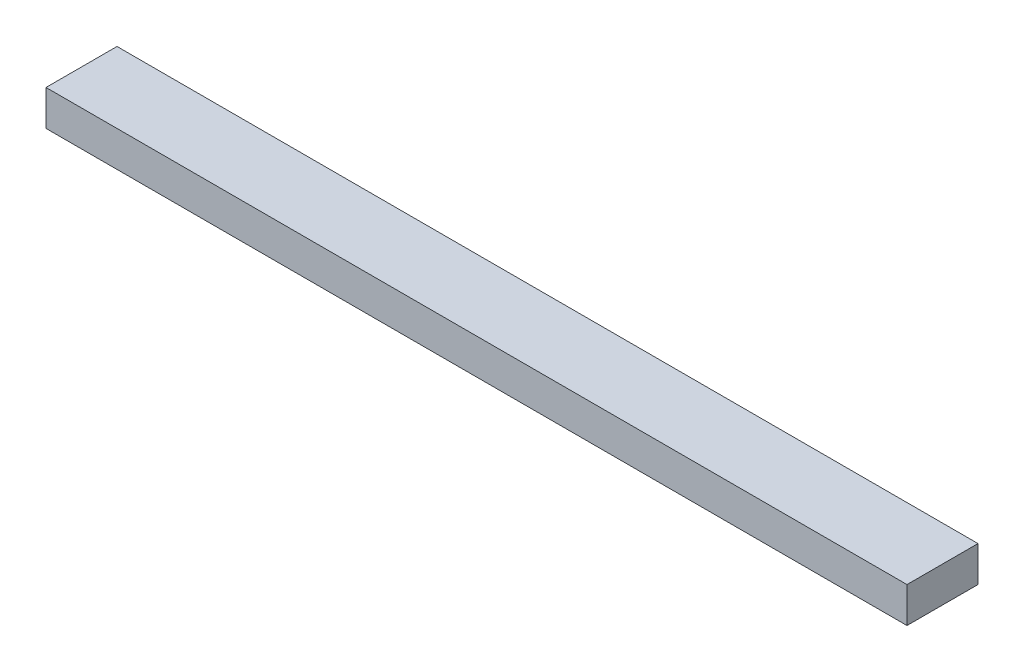
ISO-10303-21;
HEADER;
FILE_DESCRIPTION(('STEP AP214'),'2;1');
FILE_NAME('part.step','',(''),(''),'','','');
FILE_SCHEMA(('AUTOMOTIVE_DESIGN { 1 0 10303 214 1 1 1 1 }'));
ENDSEC;
DATA;
#1=APPLICATION_CONTEXT('core data for automotive mechanical design processes');
#2=APPLICATION_PROTOCOL_DEFINITION('international standard','automotive_design',2000,#1);
#3=PRODUCT_CONTEXT('',#1,'mechanical');
#4=PRODUCT('Part','Part','',(#3));
#5=PRODUCT_RELATED_PRODUCT_CATEGORY('part','',(#4));
#6=PRODUCT_DEFINITION_FORMATION('','',#4);
#7=PRODUCT_DEFINITION_CONTEXT('part definition',#1,'design');
#8=PRODUCT_DEFINITION('design','',#6,#7);
#9=PRODUCT_DEFINITION_SHAPE('','',#8);
#10=(LENGTH_UNIT() NAMED_UNIT(*) SI_UNIT(.MILLI.,.METRE.));
#11=(NAMED_UNIT(*) PLANE_ANGLE_UNIT() SI_UNIT($,.RADIAN.));
#12=(NAMED_UNIT(*) SI_UNIT($,.STERADIAN.) SOLID_ANGLE_UNIT());
#13=UNCERTAINTY_MEASURE_WITH_UNIT(LENGTH_MEASURE(1.E-05),#10,'distance_accuracy_value','');
#14=(GEOMETRIC_REPRESENTATION_CONTEXT(3) GLOBAL_UNCERTAINTY_ASSIGNED_CONTEXT((#13)) GLOBAL_UNIT_ASSIGNED_CONTEXT((#10,
#11,#12)) REPRESENTATION_CONTEXT('',''));
#15=CARTESIAN_POINT('',(0.,0.,0.));
#16=DIRECTION('',(0.,0.,1.));
#17=DIRECTION('',(1.,0.,0.));
#18=AXIS2_PLACEMENT_3D('',#15,#16,#17);
#19=CARTESIAN_POINT('',(12.12500242,-0.499999,0.));
#20=DIRECTION('',(0.,-1.,0.));
#21=DIRECTION('',(0.,0.,-1.));
#22=AXIS2_PLACEMENT_3D('',#19,#20,#21);
#23=PLANE('',#22);
#24=DIRECTION('',(0.,0.,1.));
#25=VECTOR('',#24,1.);
#26=CARTESIAN_POINT('',(-12.12499988,-0.499999,0.));
#27=LINE('',#26,#25);
#28=CARTESIAN_POINT('',(-12.12499988,-0.499999,0.));
#29=VERTEX_POINT('',#28);
#30=CARTESIAN_POINT('',(-12.12499988,-0.499999,2.00000108));
#31=VERTEX_POINT('',#30);
#32=EDGE_CURVE('E20',#29,#31,#27,.T.);
#33=ORIENTED_EDGE('',*,*,#32,.F.);
#34=DIRECTION('',(1.,0.,0.));
#35=VECTOR('',#34,1.);
#36=CARTESIAN_POINT('',(-12.12499988,-0.499999,0.));
#37=LINE('',#36,#35);
#38=CARTESIAN_POINT('',(12.12500242,-0.499999,0.));
#39=VERTEX_POINT('',#38);
#40=EDGE_CURVE('E79',#29,#39,#37,.T.);
#41=ORIENTED_EDGE('',*,*,#40,.T.);
#42=DIRECTION('',(0.,0.,-1.));
#43=VECTOR('',#42,1.);
#44=CARTESIAN_POINT('',(12.12500242,-0.499999,0.));
#45=LINE('',#44,#43);
#46=CARTESIAN_POINT('',(12.12500242,-0.499999,2.00000108));
#47=VERTEX_POINT('',#46);
#48=EDGE_CURVE('E61',#47,#39,#45,.T.);
#49=ORIENTED_EDGE('',*,*,#48,.F.);
#50=DIRECTION('',(1.,0.,0.));
#51=VECTOR('',#50,1.);
#52=CARTESIAN_POINT('',(-12.12499988,-0.499999,2.00000108));
#53=LINE('',#52,#51);
#54=EDGE_CURVE('E56',#31,#47,#53,.T.);
#55=ORIENTED_EDGE('',*,*,#54,.F.);
#56=EDGE_LOOP('',(#33,#41,#49,#55));
#57=FACE_BOUND('',#56,.T.);
#58=ADVANCED_FACE('F17',(#57),#23,.T.);
#59=CARTESIAN_POINT('',(-12.12499988,-0.499999,0.));
#60=DIRECTION('',(-1.,0.,0.));
#61=DIRECTION('',(0.,0.,1.));
#62=AXIS2_PLACEMENT_3D('',#59,#60,#61);
#63=PLANE('',#62);
#64=DIRECTION('',(0.,0.,1.));
#65=VECTOR('',#64,1.);
#66=CARTESIAN_POINT('',(-12.12499988,0.50000154,0.));
#67=LINE('',#66,#65);
#68=CARTESIAN_POINT('',(-12.12499988,0.50000154,0.));
#69=VERTEX_POINT('',#68);
#70=CARTESIAN_POINT('',(-12.12499988,0.50000154,2.00000108));
#71=VERTEX_POINT('',#70);
#72=EDGE_CURVE('E83',#69,#71,#67,.T.);
#73=ORIENTED_EDGE('',*,*,#72,.F.);
#74=DIRECTION('',(0.,1.,0.));
#75=VECTOR('',#74,1.);
#76=CARTESIAN_POINT('',(-12.12499988,-0.499999,0.));
#77=LINE('',#76,#75);
#78=EDGE_CURVE('E68',#69,#29,#77,.F.);
#79=ORIENTED_EDGE('',*,*,#78,.T.);
#80=ORIENTED_EDGE('',*,*,#32,.T.);
#81=DIRECTION('',(0.,1.,0.));
#82=VECTOR('',#81,1.);
#83=CARTESIAN_POINT('',(-12.12499988,-0.499999,2.00000108));
#84=LINE('',#83,#82);
#85=EDGE_CURVE('E63',#71,#31,#84,.F.);
#86=ORIENTED_EDGE('',*,*,#85,.F.);
#87=EDGE_LOOP('',(#73,#79,#80,#86));
#88=FACE_BOUND('',#87,.T.);
#89=ADVANCED_FACE('F65',(#88),#63,.T.);
#90=CARTESIAN_POINT('',(-12.12499988,-0.499999,2.00000108));
#91=DIRECTION('',(0.,0.,1.));
#92=DIRECTION('',(1.,0.,0.));
#93=AXIS2_PLACEMENT_3D('',#90,#91,#92);
#94=PLANE('',#93);
#95=DIRECTION('',(1.,0.,0.));
#96=VECTOR('',#95,1.);
#97=CARTESIAN_POINT('',(-12.12499988,0.50000154,2.00000108));
#98=LINE('',#97,#96);
#99=CARTESIAN_POINT('',(12.12500242,0.50000154,2.00000108));
#100=VERTEX_POINT('',#99);
#101=EDGE_CURVE('E72',#71,#100,#98,.T.);
#102=ORIENTED_EDGE('',*,*,#101,.F.);
#103=ORIENTED_EDGE('',*,*,#85,.T.);
#104=ORIENTED_EDGE('',*,*,#54,.T.);
#105=DIRECTION('',(0.,1.,0.));
#106=VECTOR('',#105,1.);
#107=CARTESIAN_POINT('',(12.12500242,0.50000154,2.00000108));
#108=LINE('',#107,#106);
#109=EDGE_CURVE('E74',#100,#47,#108,.F.);
#110=ORIENTED_EDGE('',*,*,#109,.F.);
#111=EDGE_LOOP('',(#102,#103,#104,#110));
#112=FACE_BOUND('',#111,.T.);
#113=ADVANCED_FACE('F70',(#112),#94,.T.);
#114=CARTESIAN_POINT('',(12.12500242,0.50000154,0.));
#115=DIRECTION('',(1.,0.,0.));
#116=DIRECTION('',(0.,0.,-1.));
#117=AXIS2_PLACEMENT_3D('',#114,#115,#116);
#118=PLANE('',#117);
#119=ORIENTED_EDGE('',*,*,#48,.T.);
#120=DIRECTION('',(0.,1.,0.));
#121=VECTOR('',#120,1.);
#122=CARTESIAN_POINT('',(12.12500242,-0.499999,0.));
#123=LINE('',#122,#121);
#124=CARTESIAN_POINT('',(12.12500242,0.50000154,0.));
#125=VERTEX_POINT('',#124);
#126=EDGE_CURVE('E35',#39,#125,#123,.T.);
#127=ORIENTED_EDGE('',*,*,#126,.T.);
#128=DIRECTION('',(0.,0.,1.));
#129=VECTOR('',#128,1.);
#130=CARTESIAN_POINT('',(12.12500242,0.50000154,0.));
#131=LINE('',#130,#129);
#132=EDGE_CURVE('E26',#100,#125,#131,.F.);
#133=ORIENTED_EDGE('',*,*,#132,.F.);
#134=ORIENTED_EDGE('',*,*,#109,.T.);
#135=EDGE_LOOP('',(#119,#127,#133,#134));
#136=FACE_BOUND('',#135,.T.);
#137=ADVANCED_FACE('F89',(#136),#118,.T.);
#138=CARTESIAN_POINT('',(-12.12499988,-0.499999,0.));
#139=DIRECTION('',(0.,0.,1.));
#140=DIRECTION('',(1.,0.,0.));
#141=AXIS2_PLACEMENT_3D('',#138,#139,#140);
#142=PLANE('',#141);
#143=DIRECTION('',(1.,0.,0.));
#144=VECTOR('',#143,1.);
#145=CARTESIAN_POINT('',(-12.12499988,0.50000154,0.));
#146=LINE('',#145,#144);
#147=EDGE_CURVE('E11',#125,#69,#146,.F.);
#148=ORIENTED_EDGE('',*,*,#147,.F.);
#149=ORIENTED_EDGE('',*,*,#126,.F.);
#150=ORIENTED_EDGE('',*,*,#40,.F.);
#151=ORIENTED_EDGE('',*,*,#78,.F.);
#152=EDGE_LOOP('',(#148,#149,#150,#151));
#153=FACE_BOUND('',#152,.T.);
#154=ADVANCED_FACE('F91',(#153),#142,.F.);
#155=CARTESIAN_POINT('',(-12.12499988,0.50000154,0.));
#156=DIRECTION('',(0.,1.,0.));
#157=DIRECTION('',(0.,0.,1.));
#158=AXIS2_PLACEMENT_3D('',#155,#156,#157);
#159=PLANE('',#158);
#160=ORIENTED_EDGE('',*,*,#132,.T.);
#161=ORIENTED_EDGE('',*,*,#147,.T.);
#162=ORIENTED_EDGE('',*,*,#72,.T.);
#163=ORIENTED_EDGE('',*,*,#101,.T.);
#164=EDGE_LOOP('',(#160,#161,#162,#163));
#165=FACE_BOUND('',#164,.T.);
#166=ADVANCED_FACE('F88',(#165),#159,.T.);
#167=CLOSED_SHELL('',(#58,#89,#113,#137,#154,#166));
#168=MANIFOLD_SOLID_BREP('B1',#167);
#169=ADVANCED_BREP_SHAPE_REPRESENTATION('',(#18,#168),#14);
#170=SHAPE_DEFINITION_REPRESENTATION(#9,#169);
ENDSEC;
END-ISO-10303-21;
